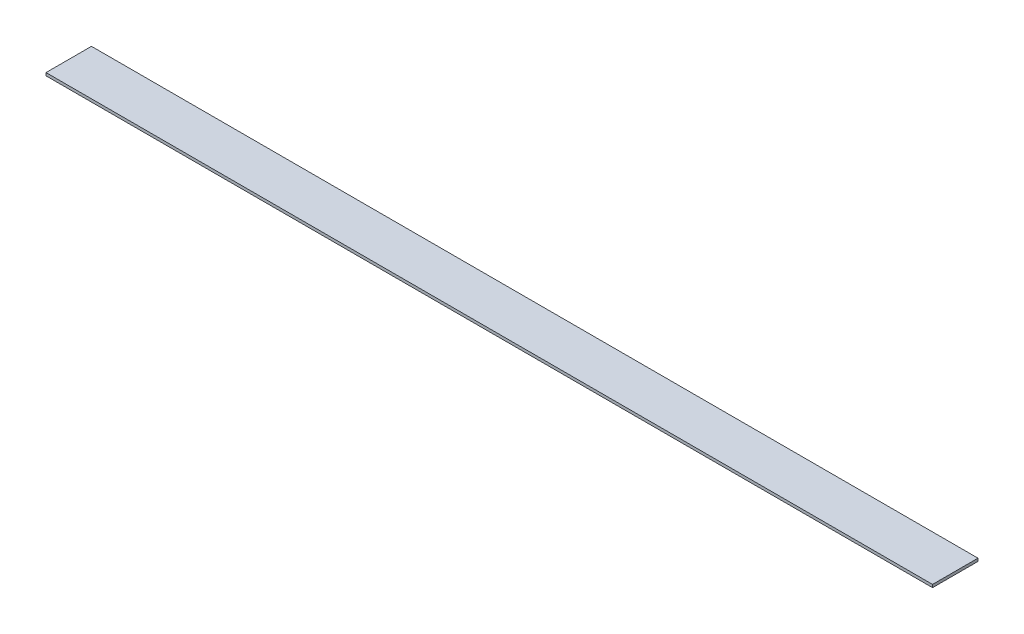
ISO-10303-21;
HEADER;
FILE_DESCRIPTION(('STEP AP214'),'2;1');
FILE_NAME('part.step','',(''),(''),'','','');
FILE_SCHEMA(('AUTOMOTIVE_DESIGN { 1 0 10303 214 1 1 1 1 }'));
ENDSEC;
DATA;
#1=APPLICATION_CONTEXT('core data for automotive mechanical design processes');
#2=APPLICATION_PROTOCOL_DEFINITION('international standard','automotive_design',2000,#1);
#3=PRODUCT_CONTEXT('',#1,'mechanical');
#4=PRODUCT('Part','Part','',(#3));
#5=PRODUCT_RELATED_PRODUCT_CATEGORY('part','',(#4));
#6=PRODUCT_DEFINITION_FORMATION('','',#4);
#7=PRODUCT_DEFINITION_CONTEXT('part definition',#1,'design');
#8=PRODUCT_DEFINITION('design','',#6,#7);
#9=PRODUCT_DEFINITION_SHAPE('','',#8);
#10=(LENGTH_UNIT() NAMED_UNIT(*) SI_UNIT(.MILLI.,.METRE.));
#11=(NAMED_UNIT(*) PLANE_ANGLE_UNIT() SI_UNIT($,.RADIAN.));
#12=(NAMED_UNIT(*) SI_UNIT($,.STERADIAN.) SOLID_ANGLE_UNIT());
#13=UNCERTAINTY_MEASURE_WITH_UNIT(LENGTH_MEASURE(1.E-05),#10,'distance_accuracy_value','');
#14=(GEOMETRIC_REPRESENTATION_CONTEXT(3) GLOBAL_UNCERTAINTY_ASSIGNED_CONTEXT((#13)) GLOBAL_UNIT_ASSIGNED_CONTEXT((#10,
#11,#12)) REPRESENTATION_CONTEXT('',''));
#15=CARTESIAN_POINT('',(0.,0.,0.));
#16=DIRECTION('',(0.,0.,1.));
#17=DIRECTION('',(1.,0.,0.));
#18=AXIS2_PLACEMENT_3D('',#15,#16,#17);
#19=CARTESIAN_POINT('',(-495.3,3.175,25.4000000000001));
#20=DIRECTION('',(1.,0.,0.));
#21=DIRECTION('',(0.,0.,-1.));
#22=AXIS2_PLACEMENT_3D('',#19,#20,#21);
#23=PLANE('',#22);
#24=DIRECTION('',(0.,0.,1.));
#25=VECTOR('',#24,1.);
#26=CARTESIAN_POINT('',(-495.3,0.,25.4000000000001));
#27=LINE('',#26,#25);
#28=CARTESIAN_POINT('',(-495.3,0.,-25.3999999999999));
#29=VERTEX_POINT('',#28);
#30=CARTESIAN_POINT('',(-495.3,0.,25.4000000000001));
#31=VERTEX_POINT('',#30);
#32=EDGE_CURVE('E95',#29,#31,#27,.T.);
#33=ORIENTED_EDGE('',*,*,#32,.T.);
#34=DIRECTION('',(0.,-1.,0.));
#35=VECTOR('',#34,1.);
#36=CARTESIAN_POINT('',(-495.3,3.175,25.4000000000001));
#37=LINE('',#36,#35);
#38=CARTESIAN_POINT('',(-495.3,3.175,25.4000000000001));
#39=VERTEX_POINT('',#38);
#40=EDGE_CURVE('E11',#39,#31,#37,.T.);
#41=ORIENTED_EDGE('',*,*,#40,.F.);
#42=DIRECTION('',(0.,0.,1.));
#43=VECTOR('',#42,1.);
#44=CARTESIAN_POINT('',(-495.3,3.175,25.4000000000001));
#45=LINE('',#44,#43);
#46=CARTESIAN_POINT('',(-495.3,3.175,-25.3999999999999));
#47=VERTEX_POINT('',#46);
#48=EDGE_CURVE('E83',#47,#39,#45,.T.);
#49=ORIENTED_EDGE('',*,*,#48,.F.);
#50=DIRECTION('',(0.,-1.,0.));
#51=VECTOR('',#50,1.);
#52=CARTESIAN_POINT('',(-495.3,3.175,-25.3999999999999));
#53=LINE('',#52,#51);
#54=EDGE_CURVE('E91',#47,#29,#53,.T.);
#55=ORIENTED_EDGE('',*,*,#54,.T.);
#56=EDGE_LOOP('',(#33,#41,#49,#55));
#57=FACE_BOUND('',#56,.T.);
#58=ADVANCED_FACE('F32',(#57),#23,.F.);
#59=CARTESIAN_POINT('',(495.3,3.175,25.3999999999999));
#60=DIRECTION('',(0.,0.,-1.));
#61=DIRECTION('',(-1.,0.,0.));
#62=AXIS2_PLACEMENT_3D('',#59,#60,#61);
#63=PLANE('',#62);
#64=DIRECTION('',(1.,0.,0.));
#65=VECTOR('',#64,1.);
#66=CARTESIAN_POINT('',(495.3,0.,25.3999999999999));
#67=LINE('',#66,#65);
#68=CARTESIAN_POINT('',(495.3,0.,25.3999999999999));
#69=VERTEX_POINT('',#68);
#70=EDGE_CURVE('E87',#31,#69,#67,.T.);
#71=ORIENTED_EDGE('',*,*,#70,.T.);
#72=DIRECTION('',(0.,-1.,0.));
#73=VECTOR('',#72,1.);
#74=CARTESIAN_POINT('',(495.3,3.175,25.3999999999999));
#75=LINE('',#74,#73);
#76=CARTESIAN_POINT('',(495.3,3.175,25.3999999999999));
#77=VERTEX_POINT('',#76);
#78=EDGE_CURVE('E40',#77,#69,#75,.T.);
#79=ORIENTED_EDGE('',*,*,#78,.F.);
#80=DIRECTION('',(1.,0.,0.));
#81=VECTOR('',#80,1.);
#82=CARTESIAN_POINT('',(495.3,3.175,25.3999999999999));
#83=LINE('',#82,#81);
#84=EDGE_CURVE('E78',#39,#77,#83,.T.);
#85=ORIENTED_EDGE('',*,*,#84,.F.);
#86=ORIENTED_EDGE('',*,*,#40,.T.);
#87=EDGE_LOOP('',(#71,#79,#85,#86));
#88=FACE_BOUND('',#87,.T.);
#89=ADVANCED_FACE('F86',(#88),#63,.F.);
#90=CARTESIAN_POINT('',(495.3,3.175,25.3999999999999));
#91=DIRECTION('',(-1.,0.,0.));
#92=DIRECTION('',(0.,0.,1.));
#93=AXIS2_PLACEMENT_3D('',#90,#91,#92);
#94=PLANE('',#93);
#95=DIRECTION('',(0.,0.,-1.));
#96=VECTOR('',#95,1.);
#97=CARTESIAN_POINT('',(495.3,0.,25.3999999999999));
#98=LINE('',#97,#96);
#99=CARTESIAN_POINT('',(495.3,0.,-25.4000000000001));
#100=VERTEX_POINT('',#99);
#101=EDGE_CURVE('E65',#69,#100,#98,.T.);
#102=ORIENTED_EDGE('',*,*,#101,.T.);
#103=DIRECTION('',(0.,-1.,0.));
#104=VECTOR('',#103,1.);
#105=CARTESIAN_POINT('',(495.3,3.175,-25.4000000000001));
#106=LINE('',#105,#104);
#107=CARTESIAN_POINT('',(495.3,3.175,-25.4000000000001));
#108=VERTEX_POINT('',#107);
#109=EDGE_CURVE('E88',#108,#100,#106,.T.);
#110=ORIENTED_EDGE('',*,*,#109,.F.);
#111=DIRECTION('',(0.,0.,-1.));
#112=VECTOR('',#111,1.);
#113=CARTESIAN_POINT('',(495.3,3.175,25.3999999999999));
#114=LINE('',#113,#112);
#115=EDGE_CURVE('E81',#77,#108,#114,.T.);
#116=ORIENTED_EDGE('',*,*,#115,.F.);
#117=ORIENTED_EDGE('',*,*,#78,.T.);
#118=EDGE_LOOP('',(#102,#110,#116,#117));
#119=FACE_BOUND('',#118,.T.);
#120=ADVANCED_FACE('F89',(#119),#94,.F.);
#121=CARTESIAN_POINT('',(495.3,3.175,-25.4000000000001));
#122=DIRECTION('',(0.,0.,1.));
#123=DIRECTION('',(1.,0.,0.));
#124=AXIS2_PLACEMENT_3D('',#121,#122,#123);
#125=PLANE('',#124);
#126=DIRECTION('',(-1.,0.,0.));
#127=VECTOR('',#126,1.);
#128=CARTESIAN_POINT('',(495.3,0.,-25.4000000000001));
#129=LINE('',#128,#127);
#130=EDGE_CURVE('E71',#100,#29,#129,.T.);
#131=ORIENTED_EDGE('',*,*,#130,.T.);
#132=ORIENTED_EDGE('',*,*,#54,.F.);
#133=DIRECTION('',(-1.,0.,0.));
#134=VECTOR('',#133,1.);
#135=CARTESIAN_POINT('',(495.3,3.175,-25.4000000000001));
#136=LINE('',#135,#134);
#137=EDGE_CURVE('E48',#108,#47,#136,.T.);
#138=ORIENTED_EDGE('',*,*,#137,.F.);
#139=ORIENTED_EDGE('',*,*,#109,.T.);
#140=EDGE_LOOP('',(#131,#132,#138,#139));
#141=FACE_BOUND('',#140,.T.);
#142=ADVANCED_FACE('F102',(#141),#125,.F.);
#143=CARTESIAN_POINT('',(0.,3.175,0.));
#144=DIRECTION('',(0.,1.,0.));
#145=DIRECTION('',(0.,0.,1.));
#146=AXIS2_PLACEMENT_3D('',#143,#144,#145);
#147=PLANE('',#146);
#148=ORIENTED_EDGE('',*,*,#48,.T.);
#149=ORIENTED_EDGE('',*,*,#84,.T.);
#150=ORIENTED_EDGE('',*,*,#115,.T.);
#151=ORIENTED_EDGE('',*,*,#137,.T.);
#152=EDGE_LOOP('',(#148,#149,#150,#151));
#153=FACE_BOUND('',#152,.T.);
#154=ADVANCED_FACE('F79',(#153),#147,.T.);
#155=CARTESIAN_POINT('',(0.,0.,0.));
#156=DIRECTION('',(0.,1.,0.));
#157=DIRECTION('',(0.,0.,1.));
#158=AXIS2_PLACEMENT_3D('',#155,#156,#157);
#159=PLANE('',#158);
#160=ORIENTED_EDGE('',*,*,#32,.F.);
#161=ORIENTED_EDGE('',*,*,#130,.F.);
#162=ORIENTED_EDGE('',*,*,#101,.F.);
#163=ORIENTED_EDGE('',*,*,#70,.F.);
#164=EDGE_LOOP('',(#160,#161,#162,#163));
#165=FACE_BOUND('',#164,.T.);
#166=ADVANCED_FACE('F105',(#165),#159,.F.);
#167=CLOSED_SHELL('',(#58,#89,#120,#142,#154,#166));
#168=MANIFOLD_SOLID_BREP('B2',#167);
#169=ADVANCED_BREP_SHAPE_REPRESENTATION('',(#18,#168),#14);
#170=SHAPE_DEFINITION_REPRESENTATION(#9,#169);
ENDSEC;
END-ISO-10303-21;
